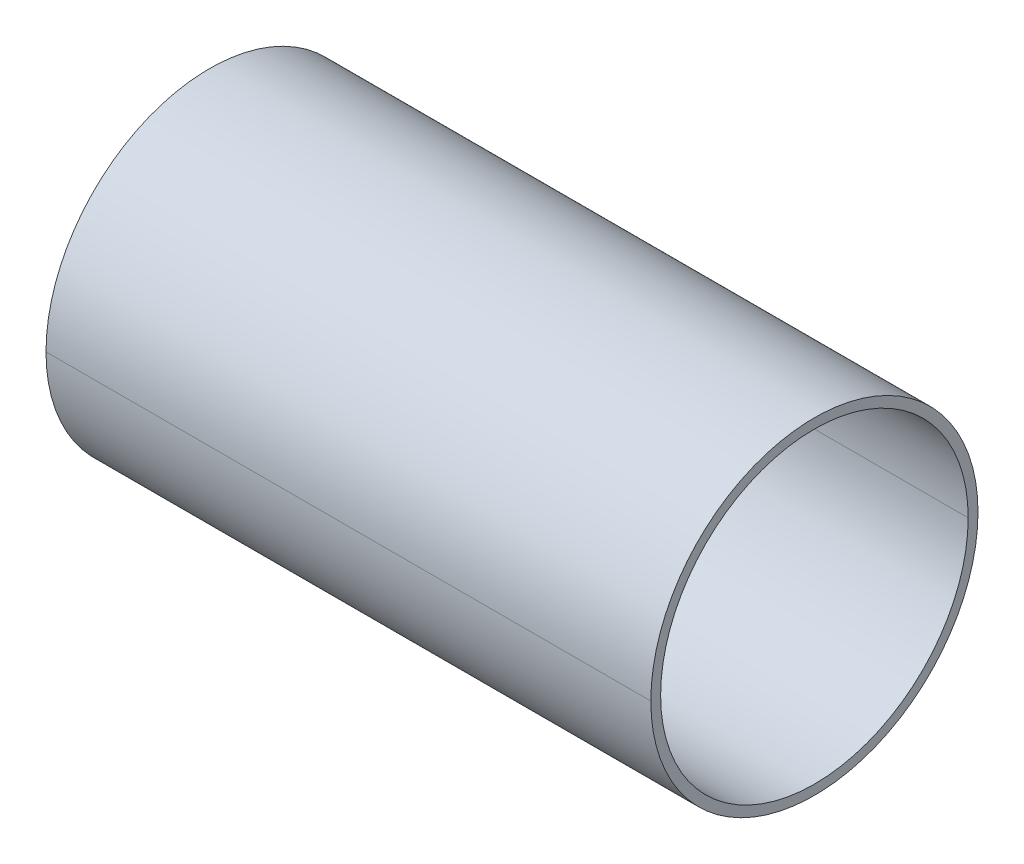
ISO-10303-21;
HEADER;
FILE_DESCRIPTION(('STEP AP214'),'2;1');
FILE_NAME('part.step','',(''),(''),'','','');
FILE_SCHEMA(('AUTOMOTIVE_DESIGN { 1 0 10303 214 1 1 1 1 }'));
ENDSEC;
DATA;
#1=APPLICATION_CONTEXT('core data for automotive mechanical design processes');
#2=APPLICATION_PROTOCOL_DEFINITION('international standard','automotive_design',2000,#1);
#3=PRODUCT_CONTEXT('',#1,'mechanical');
#4=PRODUCT('Part','Part','',(#3));
#5=PRODUCT_RELATED_PRODUCT_CATEGORY('part','',(#4));
#6=PRODUCT_DEFINITION_FORMATION('','',#4);
#7=PRODUCT_DEFINITION_CONTEXT('part definition',#1,'design');
#8=PRODUCT_DEFINITION('design','',#6,#7);
#9=PRODUCT_DEFINITION_SHAPE('','',#8);
#10=(LENGTH_UNIT() NAMED_UNIT(*) SI_UNIT(.MILLI.,.METRE.));
#11=(NAMED_UNIT(*) PLANE_ANGLE_UNIT() SI_UNIT($,.RADIAN.));
#12=(NAMED_UNIT(*) SI_UNIT($,.STERADIAN.) SOLID_ANGLE_UNIT());
#13=UNCERTAINTY_MEASURE_WITH_UNIT(LENGTH_MEASURE(1.E-05),#10,'distance_accuracy_value','');
#14=(GEOMETRIC_REPRESENTATION_CONTEXT(3) GLOBAL_UNCERTAINTY_ASSIGNED_CONTEXT((#13)) GLOBAL_UNIT_ASSIGNED_CONTEXT((#10,
#11,#12)) REPRESENTATION_CONTEXT('',''));
#15=CARTESIAN_POINT('',(0.,0.,0.));
#16=DIRECTION('',(0.,0.,1.));
#17=DIRECTION('',(1.,0.,0.));
#18=AXIS2_PLACEMENT_3D('',#15,#16,#17);
#19=CARTESIAN_POINT('',(120.2,0.,0.));
#20=DIRECTION('',(1.,0.,0.));
#21=DIRECTION('',(0.,0.,1.));
#22=AXIS2_PLACEMENT_3D('',#19,#20,#21);
#23=CYLINDRICAL_SURFACE('',#22,17.5);
#24=DIRECTION('',(1.,0.,0.));
#25=VECTOR('',#24,1.);
#26=CARTESIAN_POINT('',(120.2,0.,17.5));
#27=LINE('',#26,#25);
#28=CARTESIAN_POINT('',(87.85,0.,17.5));
#29=VERTEX_POINT('',#28);
#30=CARTESIAN_POINT('',(152.55,0.,17.5));
#31=VERTEX_POINT('',#30);
#32=EDGE_CURVE('E132',#29,#31,#27,.T.);
#33=ORIENTED_EDGE('',*,*,#32,.T.);
#34=CARTESIAN_POINT('',(152.55,0.,0.));
#35=DIRECTION('',(1.,0.,0.));
#36=DIRECTION('',(0.,0.,1.));
#37=AXIS2_PLACEMENT_3D('',#34,#35,#36);
#38=CIRCLE('',#37,17.5);
#39=CARTESIAN_POINT('',(152.55,0.,-17.5));
#40=VERTEX_POINT('',#39);
#41=EDGE_CURVE('E124',#40,#31,#38,.T.);
#42=ORIENTED_EDGE('',*,*,#41,.F.);
#43=DIRECTION('',(-1.,0.,0.));
#44=VECTOR('',#43,1.);
#45=CARTESIAN_POINT('',(120.2,0.,-17.5));
#46=LINE('',#45,#44);
#47=CARTESIAN_POINT('',(87.85,0.,-17.5));
#48=VERTEX_POINT('',#47);
#49=EDGE_CURVE('E131',#40,#48,#46,.T.);
#50=ORIENTED_EDGE('',*,*,#49,.T.);
#51=CARTESIAN_POINT('',(87.85,0.,0.));
#52=DIRECTION('',(1.,0.,0.));
#53=DIRECTION('',(0.,0.,1.));
#54=AXIS2_PLACEMENT_3D('',#51,#52,#53);
#55=CIRCLE('',#54,17.5);
#56=EDGE_CURVE('E11',#48,#29,#55,.T.);
#57=ORIENTED_EDGE('',*,*,#56,.T.);
#58=EDGE_LOOP('',(#33,#42,#50,#57));
#59=FACE_BOUND('',#58,.T.);
#60=ADVANCED_FACE('F17',(#59),#23,.T.);
#61=CARTESIAN_POINT('',(87.85,0.,12.5));
#62=DIRECTION('',(-1.,0.,0.));
#63=DIRECTION('',(0.,0.,1.));
#64=AXIS2_PLACEMENT_3D('',#61,#62,#63);
#65=PLANE('',#64);
#66=CARTESIAN_POINT('',(87.85,0.,0.));
#67=DIRECTION('',(1.,0.,0.));
#68=DIRECTION('',(0.,0.,1.));
#69=AXIS2_PLACEMENT_3D('',#66,#67,#68);
#70=CIRCLE('',#69,7.5);
#71=CARTESIAN_POINT('',(87.85,0.,7.5));
#72=VERTEX_POINT('',#71);
#73=CARTESIAN_POINT('',(87.85,0.,-7.5));
#74=VERTEX_POINT('',#73);
#75=EDGE_CURVE('E27',#72,#74,#70,.T.);
#76=ORIENTED_EDGE('',*,*,#75,.T.);
#77=CARTESIAN_POINT('',(87.85,0.,0.));
#78=DIRECTION('',(1.,0.,0.));
#79=DIRECTION('',(0.,0.,1.));
#80=AXIS2_PLACEMENT_3D('',#77,#78,#79);
#81=CIRCLE('',#80,7.5);
#82=EDGE_CURVE('E21',#74,#72,#81,.T.);
#83=ORIENTED_EDGE('',*,*,#82,.T.);
#84=EDGE_LOOP('',(#76,#83));
#85=FACE_BOUND('',#84,.T.);
#86=CARTESIAN_POINT('',(87.85,0.,0.));
#87=DIRECTION('',(1.,0.,0.));
#88=DIRECTION('',(0.,0.,1.));
#89=AXIS2_PLACEMENT_3D('',#86,#87,#88);
#90=CIRCLE('',#89,17.5);
#91=EDGE_CURVE('E127',#29,#48,#90,.T.);
#92=ORIENTED_EDGE('',*,*,#91,.F.);
#93=ORIENTED_EDGE('',*,*,#56,.F.);
#94=EDGE_LOOP('',(#92,#93));
#95=FACE_BOUND('',#94,.T.);
#96=ADVANCED_FACE('F217',(#85,#95),#65,.T.);
#97=CARTESIAN_POINT('',(120.2,0.,0.));
#98=DIRECTION('',(1.,0.,0.));
#99=DIRECTION('',(0.,0.,1.));
#100=AXIS2_PLACEMENT_3D('',#97,#98,#99);
#101=CYLINDRICAL_SURFACE('',#100,7.5);
#102=DIRECTION('',(1.,0.,0.));
#103=VECTOR('',#102,1.);
#104=CARTESIAN_POINT('',(97.9,0.,7.5));
#105=LINE('',#104,#103);
#106=CARTESIAN_POINT('',(107.95,0.,7.5));
#107=VERTEX_POINT('',#106);
#108=EDGE_CURVE('E149',#72,#107,#105,.T.);
#109=ORIENTED_EDGE('',*,*,#108,.T.);
#110=CARTESIAN_POINT('',(107.95,0.,0.));
#111=DIRECTION('',(1.,0.,0.));
#112=DIRECTION('',(0.,0.,1.));
#113=AXIS2_PLACEMENT_3D('',#110,#111,#112);
#114=CIRCLE('',#113,7.5);
#115=CARTESIAN_POINT('',(107.95,0.,-7.5));
#116=VERTEX_POINT('',#115);
#117=EDGE_CURVE('E68',#107,#116,#114,.T.);
#118=ORIENTED_EDGE('',*,*,#117,.T.);
#119=DIRECTION('',(-1.,0.,0.));
#120=VECTOR('',#119,1.);
#121=CARTESIAN_POINT('',(97.9,0.,-7.5));
#122=LINE('',#121,#120);
#123=EDGE_CURVE('E118',#116,#74,#122,.T.);
#124=ORIENTED_EDGE('',*,*,#123,.T.);
#125=ORIENTED_EDGE('',*,*,#75,.F.);
#126=EDGE_LOOP('',(#109,#118,#124,#125));
#127=FACE_BOUND('',#126,.T.);
#128=ADVANCED_FACE('F223',(#127),#101,.F.);
#129=CARTESIAN_POINT('',(152.55,0.,12.5));
#130=DIRECTION('',(1.,0.,0.));
#131=DIRECTION('',(0.,1.,0.));
#132=AXIS2_PLACEMENT_3D('',#129,#130,#131);
#133=PLANE('',#132);
#134=CARTESIAN_POINT('',(152.55,0.,0.));
#135=DIRECTION('',(-1.,0.,0.));
#136=DIRECTION('',(0.,0.,-1.));
#137=AXIS2_PLACEMENT_3D('',#134,#135,#136);
#138=CIRCLE('',#137,16.45);
#139=CARTESIAN_POINT('',(152.55,0.,-16.45));
#140=VERTEX_POINT('',#139);
#141=CARTESIAN_POINT('',(152.55,0.,16.45));
#142=VERTEX_POINT('',#141);
#143=EDGE_CURVE('E110',#140,#142,#138,.T.);
#144=ORIENTED_EDGE('',*,*,#143,.T.);
#145=CARTESIAN_POINT('',(152.55,0.,0.));
#146=DIRECTION('',(-1.,0.,0.));
#147=DIRECTION('',(0.,0.,-1.));
#148=AXIS2_PLACEMENT_3D('',#145,#146,#147);
#149=CIRCLE('',#148,16.45);
#150=EDGE_CURVE('E40',#142,#140,#149,.T.);
#151=ORIENTED_EDGE('',*,*,#150,.T.);
#152=EDGE_LOOP('',(#144,#151));
#153=FACE_BOUND('',#152,.T.);
#154=CARTESIAN_POINT('',(152.55,0.,0.));
#155=DIRECTION('',(1.,0.,0.));
#156=DIRECTION('',(0.,0.,1.));
#157=AXIS2_PLACEMENT_3D('',#154,#155,#156);
#158=CIRCLE('',#157,17.5);
#159=EDGE_CURVE('E142',#31,#40,#158,.T.);
#160=ORIENTED_EDGE('',*,*,#159,.T.);
#161=ORIENTED_EDGE('',*,*,#41,.T.);
#162=EDGE_LOOP('',(#160,#161));
#163=FACE_BOUND('',#162,.T.);
#164=ADVANCED_FACE('F233',(#153,#163),#133,.T.);
#165=CARTESIAN_POINT('',(107.95,0.,0.));
#166=DIRECTION('',(-1.,0.,0.));
#167=DIRECTION('',(0.,0.,1.));
#168=AXIS2_PLACEMENT_3D('',#165,#166,#167);
#169=PLANE('',#168);
#170=CARTESIAN_POINT('',(107.95,0.,0.));
#171=DIRECTION('',(1.,0.,0.));
#172=DIRECTION('',(0.,0.,1.));
#173=AXIS2_PLACEMENT_3D('',#170,#171,#172);
#174=CIRCLE('',#173,7.5);
#175=EDGE_CURVE('E112',#116,#107,#174,.T.);
#176=ORIENTED_EDGE('',*,*,#175,.F.);
#177=ORIENTED_EDGE('',*,*,#117,.F.);
#178=EDGE_LOOP('',(#176,#177));
#179=FACE_BOUND('',#178,.T.);
#180=CARTESIAN_POINT('',(107.95,0.,0.));
#181=DIRECTION('',(-1.,0.,0.));
#182=DIRECTION('',(0.,0.,-1.));
#183=AXIS2_PLACEMENT_3D('',#180,#181,#182);
#184=CIRCLE('',#183,16.45);
#185=CARTESIAN_POINT('',(107.95,0.,-16.45));
#186=VERTEX_POINT('',#185);
#187=CARTESIAN_POINT('',(107.95,0.,16.45));
#188=VERTEX_POINT('',#187);
#189=EDGE_CURVE('E103',#186,#188,#184,.T.);
#190=ORIENTED_EDGE('',*,*,#189,.F.);
#191=CARTESIAN_POINT('',(107.95,0.,0.));
#192=DIRECTION('',(-1.,0.,0.));
#193=DIRECTION('',(0.,0.,-1.));
#194=AXIS2_PLACEMENT_3D('',#191,#192,#193);
#195=CIRCLE('',#194,16.45);
#196=EDGE_CURVE('E52',#188,#186,#195,.T.);
#197=ORIENTED_EDGE('',*,*,#196,.F.);
#198=EDGE_LOOP('',(#190,#197));
#199=FACE_BOUND('',#198,.T.);
#200=ADVANCED_FACE('F104',(#179,#199),#169,.F.);
#201=CARTESIAN_POINT('',(130.25,0.,0.));
#202=DIRECTION('',(-1.,0.,0.));
#203=DIRECTION('',(0.,0.,-1.));
#204=AXIS2_PLACEMENT_3D('',#201,#202,#203);
#205=CYLINDRICAL_SURFACE('',#204,16.45);
#206=DIRECTION('',(1.,0.,0.));
#207=VECTOR('',#206,1.);
#208=CARTESIAN_POINT('',(130.25,0.,-16.45));
#209=LINE('',#208,#207);
#210=EDGE_CURVE('E97',#186,#140,#209,.T.);
#211=ORIENTED_EDGE('',*,*,#210,.T.);
#212=ORIENTED_EDGE('',*,*,#150,.F.);
#213=DIRECTION('',(-1.,0.,0.));
#214=VECTOR('',#213,1.);
#215=CARTESIAN_POINT('',(130.25,0.,16.45));
#216=LINE('',#215,#214);
#217=EDGE_CURVE('E99',#142,#188,#216,.T.);
#218=ORIENTED_EDGE('',*,*,#217,.T.);
#219=ORIENTED_EDGE('',*,*,#196,.T.);
#220=EDGE_LOOP('',(#211,#212,#218,#219));
#221=FACE_BOUND('',#220,.T.);
#222=ADVANCED_FACE('F95',(#221),#205,.F.);
#223=CARTESIAN_POINT('',(130.25,0.,0.));
#224=DIRECTION('',(-1.,0.,0.));
#225=DIRECTION('',(0.,0.,-1.));
#226=AXIS2_PLACEMENT_3D('',#223,#224,#225);
#227=CYLINDRICAL_SURFACE('',#226,16.45);
#228=ORIENTED_EDGE('',*,*,#210,.F.);
#229=ORIENTED_EDGE('',*,*,#189,.T.);
#230=ORIENTED_EDGE('',*,*,#217,.F.);
#231=ORIENTED_EDGE('',*,*,#143,.F.);
#232=EDGE_LOOP('',(#228,#229,#230,#231));
#233=FACE_BOUND('',#232,.T.);
#234=ADVANCED_FACE('F109',(#233),#227,.F.);
#235=CARTESIAN_POINT('',(120.2,0.,0.));
#236=DIRECTION('',(1.,0.,0.));
#237=DIRECTION('',(0.,0.,1.));
#238=AXIS2_PLACEMENT_3D('',#235,#236,#237);
#239=CYLINDRICAL_SURFACE('',#238,7.5);
#240=ORIENTED_EDGE('',*,*,#108,.F.);
#241=ORIENTED_EDGE('',*,*,#82,.F.);
#242=ORIENTED_EDGE('',*,*,#123,.F.);
#243=ORIENTED_EDGE('',*,*,#175,.T.);
#244=EDGE_LOOP('',(#240,#241,#242,#243));
#245=FACE_BOUND('',#244,.T.);
#246=ADVANCED_FACE('F248',(#245),#239,.F.);
#247=CARTESIAN_POINT('',(120.2,0.,0.));
#248=DIRECTION('',(1.,0.,0.));
#249=DIRECTION('',(0.,0.,1.));
#250=AXIS2_PLACEMENT_3D('',#247,#248,#249);
#251=CYLINDRICAL_SURFACE('',#250,17.5);
#252=ORIENTED_EDGE('',*,*,#32,.F.);
#253=ORIENTED_EDGE('',*,*,#91,.T.);
#254=ORIENTED_EDGE('',*,*,#49,.F.);
#255=ORIENTED_EDGE('',*,*,#159,.F.);
#256=EDGE_LOOP('',(#252,#253,#254,#255));
#257=FACE_BOUND('',#256,.T.);
#258=ADVANCED_FACE('F19',(#257),#251,.T.);
#259=CLOSED_SHELL('',(#60,#96,#128,#164,#200,#222,#234,#246,#258));
#260=MANIFOLD_SOLID_BREP('B1',#259);
#261=ADVANCED_BREP_SHAPE_REPRESENTATION('',(#18,#260),#14);
#262=SHAPE_DEFINITION_REPRESENTATION(#9,#261);
ENDSEC;
END-ISO-10303-21;
